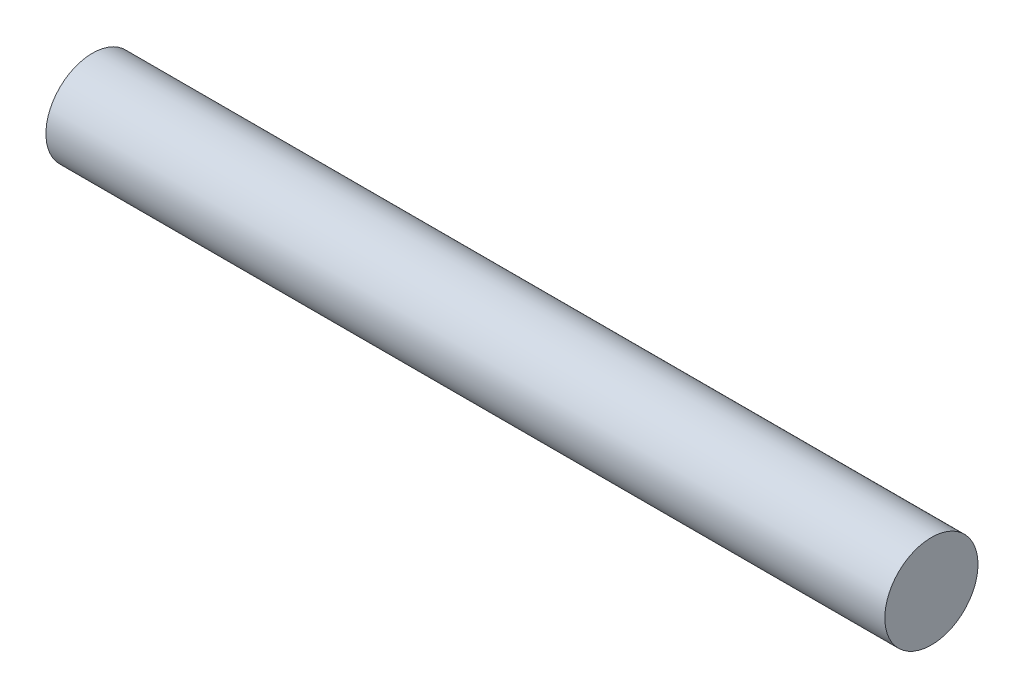
ISO-10303-21;
HEADER;
FILE_DESCRIPTION(('STEP AP214'),'2;1');
FILE_NAME('part.step','',(''),(''),'','','');
FILE_SCHEMA(('AUTOMOTIVE_DESIGN { 1 0 10303 214 1 1 1 1 }'));
ENDSEC;
DATA;
#1=APPLICATION_CONTEXT('core data for automotive mechanical design processes');
#2=APPLICATION_PROTOCOL_DEFINITION('international standard','automotive_design',2000,#1);
#3=PRODUCT_CONTEXT('',#1,'mechanical');
#4=PRODUCT('Part','Part','',(#3));
#5=PRODUCT_RELATED_PRODUCT_CATEGORY('part','',(#4));
#6=PRODUCT_DEFINITION_FORMATION('','',#4);
#7=PRODUCT_DEFINITION_CONTEXT('part definition',#1,'design');
#8=PRODUCT_DEFINITION('design','',#6,#7);
#9=PRODUCT_DEFINITION_SHAPE('','',#8);
#10=(LENGTH_UNIT() NAMED_UNIT(*) SI_UNIT(.MILLI.,.METRE.));
#11=(NAMED_UNIT(*) PLANE_ANGLE_UNIT() SI_UNIT($,.RADIAN.));
#12=(NAMED_UNIT(*) SI_UNIT($,.STERADIAN.) SOLID_ANGLE_UNIT());
#13=UNCERTAINTY_MEASURE_WITH_UNIT(LENGTH_MEASURE(1.E-05),#10,'distance_accuracy_value','');
#14=(GEOMETRIC_REPRESENTATION_CONTEXT(3) GLOBAL_UNCERTAINTY_ASSIGNED_CONTEXT((#13)) GLOBAL_UNIT_ASSIGNED_CONTEXT((#10,
#11,#12)) REPRESENTATION_CONTEXT('',''));
#15=CARTESIAN_POINT('',(0.,0.,0.));
#16=DIRECTION('',(0.,0.,1.));
#17=DIRECTION('',(1.,0.,0.));
#18=AXIS2_PLACEMENT_3D('',#15,#16,#17);
#19=CARTESIAN_POINT('',(171.45,0.,0.));
#20=DIRECTION('',(-1.,0.,0.));
#21=DIRECTION('',(0.,0.,1.));
#22=AXIS2_PLACEMENT_3D('',#19,#20,#21);
#23=CYLINDRICAL_SURFACE('',#22,9.525);
#24=CARTESIAN_POINT('',(171.45,0.,0.));
#25=DIRECTION('',(1.,0.,0.));
#26=DIRECTION('',(0.,0.,-1.));
#27=AXIS2_PLACEMENT_3D('',#24,#25,#26);
#28=CIRCLE('',#27,9.525);
#29=CARTESIAN_POINT('',(171.45,0.,-9.525));
#30=VERTEX_POINT('',#29);
#31=EDGE_CURVE('E10',#30,#30,#28,.T.);
#32=ORIENTED_EDGE('',*,*,#31,.F.);
#33=EDGE_LOOP('',(#32));
#34=FACE_BOUND('',#33,.T.);
#35=CARTESIAN_POINT('',(0.,0.,0.));
#36=DIRECTION('',(1.,0.,0.));
#37=DIRECTION('',(0.,0.,-1.));
#38=AXIS2_PLACEMENT_3D('',#35,#36,#37);
#39=CIRCLE('',#38,9.525);
#40=CARTESIAN_POINT('',(0.,0.,-9.525));
#41=VERTEX_POINT('',#40);
#42=EDGE_CURVE('E33',#41,#41,#39,.T.);
#43=ORIENTED_EDGE('',*,*,#42,.T.);
#44=EDGE_LOOP('',(#43));
#45=FACE_BOUND('',#44,.T.);
#46=ADVANCED_FACE('F30',(#34,#45),#23,.T.);
#47=CARTESIAN_POINT('',(171.45,0.,0.));
#48=DIRECTION('',(1.,0.,0.));
#49=DIRECTION('',(0.,0.,-1.));
#50=AXIS2_PLACEMENT_3D('',#47,#48,#49);
#51=PLANE('',#50);
#52=ORIENTED_EDGE('',*,*,#31,.T.);
#53=EDGE_LOOP('',(#52));
#54=FACE_BOUND('',#53,.T.);
#55=ADVANCED_FACE('F45',(#54),#51,.T.);
#56=CARTESIAN_POINT('',(0.,0.,0.));
#57=DIRECTION('',(1.,0.,0.));
#58=DIRECTION('',(0.,0.,-1.));
#59=AXIS2_PLACEMENT_3D('',#56,#57,#58);
#60=PLANE('',#59);
#61=ORIENTED_EDGE('',*,*,#42,.F.);
#62=EDGE_LOOP('',(#61));
#63=FACE_BOUND('',#62,.T.);
#64=ADVANCED_FACE('F43',(#63),#60,.F.);
#65=CLOSED_SHELL('',(#46,#55,#64));
#66=MANIFOLD_SOLID_BREP('B2',#65);
#67=ADVANCED_BREP_SHAPE_REPRESENTATION('',(#18,#66),#14);
#68=SHAPE_DEFINITION_REPRESENTATION(#9,#67);
ENDSEC;
END-ISO-10303-21;
